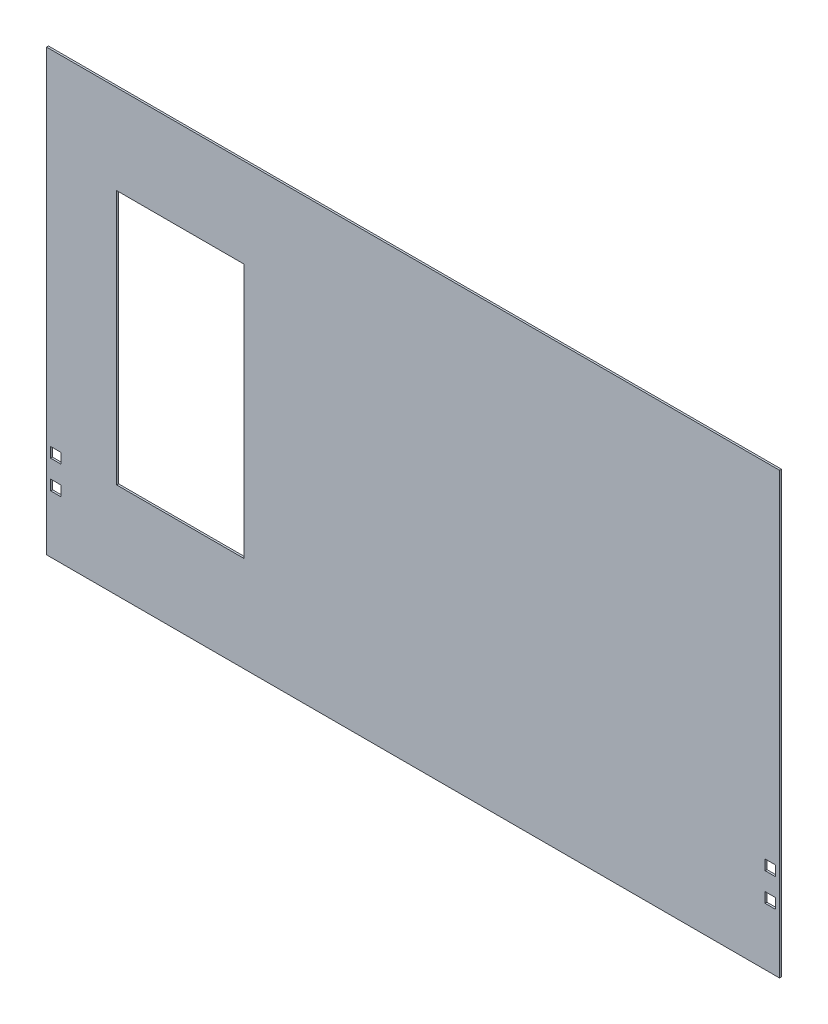
ISO-10303-21;
HEADER;
FILE_DESCRIPTION(('STEP AP214'),'2;1');
FILE_NAME('part.step','',(''),(''),'','','');
FILE_SCHEMA(('AUTOMOTIVE_DESIGN { 1 0 10303 214 1 1 1 1 }'));
ENDSEC;
DATA;
#1=APPLICATION_CONTEXT('core data for automotive mechanical design processes');
#2=APPLICATION_PROTOCOL_DEFINITION('international standard','automotive_design',2000,#1);
#3=PRODUCT_CONTEXT('',#1,'mechanical');
#4=PRODUCT('Part','Part','',(#3));
#5=PRODUCT_RELATED_PRODUCT_CATEGORY('part','',(#4));
#6=PRODUCT_DEFINITION_FORMATION('','',#4);
#7=PRODUCT_DEFINITION_CONTEXT('part definition',#1,'design');
#8=PRODUCT_DEFINITION('design','',#6,#7);
#9=PRODUCT_DEFINITION_SHAPE('','',#8);
#10=(LENGTH_UNIT() NAMED_UNIT(*) SI_UNIT(.MILLI.,.METRE.));
#11=(NAMED_UNIT(*) PLANE_ANGLE_UNIT() SI_UNIT($,.RADIAN.));
#12=(NAMED_UNIT(*) SI_UNIT($,.STERADIAN.) SOLID_ANGLE_UNIT());
#13=UNCERTAINTY_MEASURE_WITH_UNIT(LENGTH_MEASURE(1.E-05),#10,'distance_accuracy_value','');
#14=(GEOMETRIC_REPRESENTATION_CONTEXT(3) GLOBAL_UNCERTAINTY_ASSIGNED_CONTEXT((#13)) GLOBAL_UNIT_ASSIGNED_CONTEXT((#10,
#11,#12)) REPRESENTATION_CONTEXT('',''));
#15=CARTESIAN_POINT('',(0.,0.,0.));
#16=DIRECTION('',(0.,0.,1.));
#17=DIRECTION('',(1.,0.,0.));
#18=AXIS2_PLACEMENT_3D('',#15,#16,#17);
#19=CARTESIAN_POINT('',(0.,0.,-3.));
#20=DIRECTION('',(0.,0.,-1.));
#21=DIRECTION('',(-1.,0.,0.));
#22=AXIS2_PLACEMENT_3D('',#19,#20,#21);
#23=PLANE('',#22);
#24=DIRECTION('',(0.,-1.,0.));
#25=VECTOR('',#24,1.);
#26=CARTESIAN_POINT('',(-465.,260.,-3.));
#27=LINE('',#26,#25);
#28=CARTESIAN_POINT('',(-465.,260.,-3.));
#29=VERTEX_POINT('',#28);
#30=CARTESIAN_POINT('',(-465.,-140.,-3.));
#31=VERTEX_POINT('',#30);
#32=EDGE_CURVE('E395',#29,#31,#27,.T.);
#33=ORIENTED_EDGE('',*,*,#32,.T.);
#34=DIRECTION('',(1.,0.,0.));
#35=VECTOR('',#34,1.);
#36=CARTESIAN_POINT('',(-465.,-140.,-3.));
#37=LINE('',#36,#35);
#38=CARTESIAN_POINT('',(-265.,-140.,-3.));
#39=VERTEX_POINT('',#38);
#40=EDGE_CURVE('E412',#31,#39,#37,.T.);
#41=ORIENTED_EDGE('',*,*,#40,.T.);
#42=DIRECTION('',(0.,1.,0.));
#43=VECTOR('',#42,1.);
#44=CARTESIAN_POINT('',(-265.,260.,-3.));
#45=LINE('',#44,#43);
#46=CARTESIAN_POINT('',(-265.,260.,-3.));
#47=VERTEX_POINT('',#46);
#48=EDGE_CURVE('E328',#39,#47,#45,.T.);
#49=ORIENTED_EDGE('',*,*,#48,.T.);
#50=DIRECTION('',(-1.,0.,0.));
#51=VECTOR('',#50,1.);
#52=CARTESIAN_POINT('',(-465.,260.,-3.));
#53=LINE('',#52,#51);
#54=EDGE_CURVE('E392',#47,#29,#53,.T.);
#55=ORIENTED_EDGE('',*,*,#54,.T.);
#56=EDGE_LOOP('',(#33,#41,#49,#55));
#57=FACE_BOUND('',#56,.T.);
#58=DIRECTION('',(-1.,0.,0.));
#59=VECTOR('',#58,1.);
#60=CARTESIAN_POINT('',(-575.,-290.,-3.));
#61=LINE('',#60,#59);
#62=CARTESIAN_POINT('',(575.,-290.,-3.));
#63=VERTEX_POINT('',#62);
#64=CARTESIAN_POINT('',(-575.,-290.,-3.));
#65=VERTEX_POINT('',#64);
#66=EDGE_CURVE('E421',#63,#65,#61,.T.);
#67=ORIENTED_EDGE('',*,*,#66,.T.);
#68=DIRECTION('',(0.,-1.,0.));
#69=VECTOR('',#68,1.);
#70=CARTESIAN_POINT('',(-575.,-400.,-3.));
#71=LINE('',#70,#69);
#72=CARTESIAN_POINT('',(-575.,400.,-3.));
#73=VERTEX_POINT('',#72);
#74=EDGE_CURVE('E438',#73,#65,#71,.T.);
#75=ORIENTED_EDGE('',*,*,#74,.F.);
#76=DIRECTION('',(-1.,0.,0.));
#77=VECTOR('',#76,1.);
#78=CARTESIAN_POINT('',(-575.,400.,-3.));
#79=LINE('',#78,#77);
#80=CARTESIAN_POINT('',(575.,400.,-3.));
#81=VERTEX_POINT('',#80);
#82=EDGE_CURVE('E434',#81,#73,#79,.T.);
#83=ORIENTED_EDGE('',*,*,#82,.F.);
#84=DIRECTION('',(0.,1.,0.));
#85=VECTOR('',#84,1.);
#86=CARTESIAN_POINT('',(575.,-400.,-3.));
#87=LINE('',#86,#85);
#88=EDGE_CURVE('E432',#63,#81,#87,.T.);
#89=ORIENTED_EDGE('',*,*,#88,.F.);
#90=EDGE_LOOP('',(#67,#75,#83,#89));
#91=FACE_BOUND('',#90,.T.);
#92=DIRECTION('',(0.,-1.,0.));
#93=VECTOR('',#92,1.);
#94=CARTESIAN_POINT('',(568.5,-139.5,-3.));
#95=LINE('',#94,#93);
#96=CARTESIAN_POINT('',(568.5,-139.5,-3.));
#97=VERTEX_POINT('',#96);
#98=CARTESIAN_POINT('',(568.5,-155.5,-3.));
#99=VERTEX_POINT('',#98);
#100=EDGE_CURVE('E379',#97,#99,#95,.T.);
#101=ORIENTED_EDGE('',*,*,#100,.F.);
#102=DIRECTION('',(1.,0.,0.));
#103=VECTOR('',#102,1.);
#104=CARTESIAN_POINT('',(552.5,-139.5,-3.));
#105=LINE('',#104,#103);
#106=CARTESIAN_POINT('',(552.5,-139.5,-3.));
#107=VERTEX_POINT('',#106);
#108=EDGE_CURVE('E382',#107,#97,#105,.T.);
#109=ORIENTED_EDGE('',*,*,#108,.F.);
#110=DIRECTION('',(0.,1.,0.));
#111=VECTOR('',#110,1.);
#112=CARTESIAN_POINT('',(552.5,-155.5,-3.));
#113=LINE('',#112,#111);
#114=CARTESIAN_POINT('',(552.5,-155.5,-3.));
#115=VERTEX_POINT('',#114);
#116=EDGE_CURVE('E348',#115,#107,#113,.T.);
#117=ORIENTED_EDGE('',*,*,#116,.F.);
#118=DIRECTION('',(-1.,0.,0.));
#119=VECTOR('',#118,1.);
#120=CARTESIAN_POINT('',(568.5,-155.5,-3.));
#121=LINE('',#120,#119);
#122=EDGE_CURVE('E342',#99,#115,#121,.T.);
#123=ORIENTED_EDGE('',*,*,#122,.F.);
#124=EDGE_LOOP('',(#101,#109,#117,#123));
#125=FACE_BOUND('',#124,.T.);
#126=DIRECTION('',(0.,-1.,0.));
#127=VECTOR('',#126,1.);
#128=CARTESIAN_POINT('',(568.5,-183.850348269495,-3.));
#129=LINE('',#128,#127);
#130=CARTESIAN_POINT('',(568.5,-183.850348269495,-3.));
#131=VERTEX_POINT('',#130);
#132=CARTESIAN_POINT('',(568.5,-199.850348269495,-3.));
#133=VERTEX_POINT('',#132);
#134=EDGE_CURVE('E329',#131,#133,#129,.T.);
#135=ORIENTED_EDGE('',*,*,#134,.F.);
#136=DIRECTION('',(1.,0.,0.));
#137=VECTOR('',#136,1.);
#138=CARTESIAN_POINT('',(552.5,-183.850348269495,-3.));
#139=LINE('',#138,#137);
#140=CARTESIAN_POINT('',(552.5,-183.850348269495,-3.));
#141=VERTEX_POINT('',#140);
#142=EDGE_CURVE('E332',#141,#131,#139,.T.);
#143=ORIENTED_EDGE('',*,*,#142,.F.);
#144=DIRECTION('',(0.,1.,0.));
#145=VECTOR('',#144,1.);
#146=CARTESIAN_POINT('',(552.5,-199.850348269495,-3.));
#147=LINE('',#146,#145);
#148=CARTESIAN_POINT('',(552.5,-199.850348269495,-3.));
#149=VERTEX_POINT('',#148);
#150=EDGE_CURVE('E294',#149,#141,#147,.T.);
#151=ORIENTED_EDGE('',*,*,#150,.F.);
#152=DIRECTION('',(-1.,0.,0.));
#153=VECTOR('',#152,1.);
#154=CARTESIAN_POINT('',(568.5,-199.850348269495,-3.));
#155=LINE('',#154,#153);
#156=EDGE_CURVE('E323',#133,#149,#155,.T.);
#157=ORIENTED_EDGE('',*,*,#156,.F.);
#158=EDGE_LOOP('',(#135,#143,#151,#157));
#159=FACE_BOUND('',#158,.T.);
#160=DIRECTION('',(0.,1.,0.));
#161=VECTOR('',#160,1.);
#162=CARTESIAN_POINT('',(-552.5,-155.5,-3.));
#163=LINE('',#162,#161);
#164=CARTESIAN_POINT('',(-552.5,-155.5,-3.));
#165=VERTEX_POINT('',#164);
#166=CARTESIAN_POINT('',(-552.5,-139.5,-3.));
#167=VERTEX_POINT('',#166);
#168=EDGE_CURVE('E245',#165,#167,#163,.T.);
#169=ORIENTED_EDGE('',*,*,#168,.T.);
#170=DIRECTION('',(-1.,0.,0.));
#171=VECTOR('',#170,1.);
#172=CARTESIAN_POINT('',(-552.5,-139.5,-3.));
#173=LINE('',#172,#171);
#174=CARTESIAN_POINT('',(-568.5,-139.5,-3.));
#175=VERTEX_POINT('',#174);
#176=EDGE_CURVE('E59',#167,#175,#173,.T.);
#177=ORIENTED_EDGE('',*,*,#176,.T.);
#178=DIRECTION('',(0.,-1.,0.));
#179=VECTOR('',#178,1.);
#180=CARTESIAN_POINT('',(-568.5,-139.5,-3.));
#181=LINE('',#180,#179);
#182=CARTESIAN_POINT('',(-568.5,-155.5,-3.));
#183=VERTEX_POINT('',#182);
#184=EDGE_CURVE('E277',#175,#183,#181,.T.);
#185=ORIENTED_EDGE('',*,*,#184,.T.);
#186=DIRECTION('',(1.,0.,0.));
#187=VECTOR('',#186,1.);
#188=CARTESIAN_POINT('',(-568.5,-155.5,-3.));
#189=LINE('',#188,#187);
#190=EDGE_CURVE('E240',#183,#165,#189,.T.);
#191=ORIENTED_EDGE('',*,*,#190,.T.);
#192=EDGE_LOOP('',(#169,#177,#185,#191));
#193=FACE_BOUND('',#192,.T.);
#194=DIRECTION('',(0.,1.,0.));
#195=VECTOR('',#194,1.);
#196=CARTESIAN_POINT('',(-552.5,-199.850348269495,-3.));
#197=LINE('',#196,#195);
#198=CARTESIAN_POINT('',(-552.5,-199.850348269495,-3.));
#199=VERTEX_POINT('',#198);
#200=CARTESIAN_POINT('',(-552.5,-183.850348269495,-3.));
#201=VERTEX_POINT('',#200);
#202=EDGE_CURVE('E199',#199,#201,#197,.T.);
#203=ORIENTED_EDGE('',*,*,#202,.T.);
#204=DIRECTION('',(-1.,0.,0.));
#205=VECTOR('',#204,1.);
#206=CARTESIAN_POINT('',(-552.5,-183.850348269495,-3.));
#207=LINE('',#206,#205);
#208=CARTESIAN_POINT('',(-568.5,-183.850348269495,-3.));
#209=VERTEX_POINT('',#208);
#210=EDGE_CURVE('E51',#201,#209,#207,.T.);
#211=ORIENTED_EDGE('',*,*,#210,.T.);
#212=DIRECTION('',(0.,-1.,0.));
#213=VECTOR('',#212,1.);
#214=CARTESIAN_POINT('',(-568.5,-183.850348269495,-3.));
#215=LINE('',#214,#213);
#216=CARTESIAN_POINT('',(-568.5,-199.850348269495,-3.));
#217=VERTEX_POINT('',#216);
#218=EDGE_CURVE('E219',#209,#217,#215,.T.);
#219=ORIENTED_EDGE('',*,*,#218,.T.);
#220=DIRECTION('',(1.,0.,0.));
#221=VECTOR('',#220,1.);
#222=CARTESIAN_POINT('',(-568.5,-199.850348269495,-3.));
#223=LINE('',#222,#221);
#224=EDGE_CURVE('E212',#217,#199,#223,.T.);
#225=ORIENTED_EDGE('',*,*,#224,.T.);
#226=EDGE_LOOP('',(#203,#211,#219,#225));
#227=FACE_BOUND('',#226,.T.);
#228=ADVANCED_FACE('F36',(#57,#91,#125,#159,#193,#227),#23,.T.);
#229=CARTESIAN_POINT('',(0.,0.,0.));
#230=DIRECTION('',(0.,0.,-1.));
#231=DIRECTION('',(-1.,0.,0.));
#232=AXIS2_PLACEMENT_3D('',#229,#230,#231);
#233=PLANE('',#232);
#234=CARTESIAN_POINT('',(-552.5,-139.5,0.));
#235=CARTESIAN_POINT('',(-568.5,-139.5,0.));
#236=B_SPLINE_CURVE_WITH_KNOTS('',1,(#234,#235),.UNSPECIFIED.,.F.,.F.,(2,2),(0.,0.25),.UNSPECIFIED.);
#237=CARTESIAN_POINT('',(-552.5,-139.5,0.));
#238=VERTEX_POINT('',#237);
#239=CARTESIAN_POINT('',(-568.5,-139.5,0.));
#240=VERTEX_POINT('',#239);
#241=EDGE_CURVE('E264',#238,#240,#236,.T.);
#242=ORIENTED_EDGE('',*,*,#241,.F.);
#243=CARTESIAN_POINT('',(-552.5,-155.5,0.));
#244=CARTESIAN_POINT('',(-552.5,-139.5,0.));
#245=B_SPLINE_CURVE_WITH_KNOTS('',1,(#243,#244),.UNSPECIFIED.,.F.,.F.,(2,2),(0.75,1.),.UNSPECIFIED.);
#246=CARTESIAN_POINT('',(-552.5,-155.5,0.));
#247=VERTEX_POINT('',#246);
#248=EDGE_CURVE('E241',#247,#238,#245,.T.);
#249=ORIENTED_EDGE('',*,*,#248,.F.);
#250=CARTESIAN_POINT('',(-568.5,-155.5,0.));
#251=CARTESIAN_POINT('',(-552.5,-155.5,0.));
#252=B_SPLINE_CURVE_WITH_KNOTS('',1,(#250,#251),.UNSPECIFIED.,.F.,.F.,(2,2),(0.5,0.75),.UNSPECIFIED.);
#253=CARTESIAN_POINT('',(-568.5,-155.5,0.));
#254=VERTEX_POINT('',#253);
#255=EDGE_CURVE('E247',#254,#247,#252,.T.);
#256=ORIENTED_EDGE('',*,*,#255,.F.);
#257=CARTESIAN_POINT('',(-568.5,-139.5,0.));
#258=CARTESIAN_POINT('',(-568.5,-155.5,0.));
#259=B_SPLINE_CURVE_WITH_KNOTS('',1,(#257,#258),.UNSPECIFIED.,.F.,.F.,(2,2),(0.25,0.5),.UNSPECIFIED.);
#260=EDGE_CURVE('E256',#240,#254,#259,.T.);
#261=ORIENTED_EDGE('',*,*,#260,.F.);
#262=EDGE_LOOP('',(#242,#249,#256,#261));
#263=FACE_BOUND('',#262,.T.);
#264=CARTESIAN_POINT('',(552.5,-139.5,0.));
#265=CARTESIAN_POINT('',(568.5,-139.5,0.));
#266=B_SPLINE_CURVE_WITH_KNOTS('',1,(#264,#265),.UNSPECIFIED.,.F.,.F.,(2,2),(0.,0.25),.UNSPECIFIED.);
#267=CARTESIAN_POINT('',(552.5,-139.5,0.));
#268=VERTEX_POINT('',#267);
#269=CARTESIAN_POINT('',(568.5,-139.5,0.));
#270=VERTEX_POINT('',#269);
#271=EDGE_CURVE('E223',#268,#270,#266,.T.);
#272=ORIENTED_EDGE('',*,*,#271,.T.);
#273=CARTESIAN_POINT('',(568.5,-139.5,0.));
#274=CARTESIAN_POINT('',(568.5,-155.5,0.));
#275=B_SPLINE_CURVE_WITH_KNOTS('',1,(#273,#274),.UNSPECIFIED.,.F.,.F.,(2,2),(0.25,0.5),.UNSPECIFIED.);
#276=CARTESIAN_POINT('',(568.5,-155.5,0.));
#277=VERTEX_POINT('',#276);
#278=EDGE_CURVE('E359',#270,#277,#275,.T.);
#279=ORIENTED_EDGE('',*,*,#278,.T.);
#280=CARTESIAN_POINT('',(568.5,-155.5,0.));
#281=CARTESIAN_POINT('',(552.5,-155.5,0.));
#282=B_SPLINE_CURVE_WITH_KNOTS('',1,(#280,#281),.UNSPECIFIED.,.F.,.F.,(2,2),(0.5,0.75),.UNSPECIFIED.);
#283=CARTESIAN_POINT('',(552.5,-155.5,0.));
#284=VERTEX_POINT('',#283);
#285=EDGE_CURVE('E350',#277,#284,#282,.T.);
#286=ORIENTED_EDGE('',*,*,#285,.T.);
#287=CARTESIAN_POINT('',(552.5,-155.5,0.));
#288=CARTESIAN_POINT('',(552.5,-139.5,0.));
#289=B_SPLINE_CURVE_WITH_KNOTS('',1,(#287,#288),.UNSPECIFIED.,.F.,.F.,(2,2),(0.75,1.),.UNSPECIFIED.);
#290=EDGE_CURVE('E343',#284,#268,#289,.T.);
#291=ORIENTED_EDGE('',*,*,#290,.T.);
#292=EDGE_LOOP('',(#272,#279,#286,#291));
#293=FACE_BOUND('',#292,.T.);
#294=DIRECTION('',(1.,0.,0.));
#295=VECTOR('',#294,1.);
#296=CARTESIAN_POINT('',(-465.,-140.,0.));
#297=LINE('',#296,#295);
#298=CARTESIAN_POINT('',(-465.,-140.,0.));
#299=VERTEX_POINT('',#298);
#300=CARTESIAN_POINT('',(-265.,-140.,0.));
#301=VERTEX_POINT('',#300);
#302=EDGE_CURVE('E400',#299,#301,#297,.T.);
#303=ORIENTED_EDGE('',*,*,#302,.F.);
#304=DIRECTION('',(0.,-1.,0.));
#305=VECTOR('',#304,1.);
#306=CARTESIAN_POINT('',(-465.,260.,0.));
#307=LINE('',#306,#305);
#308=CARTESIAN_POINT('',(-465.,260.,0.));
#309=VERTEX_POINT('',#308);
#310=EDGE_CURVE('E398',#309,#299,#307,.T.);
#311=ORIENTED_EDGE('',*,*,#310,.F.);
#312=DIRECTION('',(-1.,0.,0.));
#313=VECTOR('',#312,1.);
#314=CARTESIAN_POINT('',(-465.,260.,0.));
#315=LINE('',#314,#313);
#316=CARTESIAN_POINT('',(-265.,260.,0.));
#317=VERTEX_POINT('',#316);
#318=EDGE_CURVE('E406',#317,#309,#315,.T.);
#319=ORIENTED_EDGE('',*,*,#318,.F.);
#320=DIRECTION('',(0.,1.,0.));
#321=VECTOR('',#320,1.);
#322=CARTESIAN_POINT('',(-265.,260.,0.));
#323=LINE('',#322,#321);
#324=EDGE_CURVE('E403',#301,#317,#323,.T.);
#325=ORIENTED_EDGE('',*,*,#324,.F.);
#326=EDGE_LOOP('',(#303,#311,#319,#325));
#327=FACE_BOUND('',#326,.T.);
#328=DIRECTION('',(0.,-1.,0.));
#329=VECTOR('',#328,1.);
#330=CARTESIAN_POINT('',(-575.,-400.,0.));
#331=LINE('',#330,#329);
#332=CARTESIAN_POINT('',(-575.,400.,0.));
#333=VERTEX_POINT('',#332);
#334=CARTESIAN_POINT('',(-575.,-290.,0.));
#335=VERTEX_POINT('',#334);
#336=EDGE_CURVE('E435',#333,#335,#331,.T.);
#337=ORIENTED_EDGE('',*,*,#336,.T.);
#338=DIRECTION('',(-1.,0.,0.));
#339=VECTOR('',#338,1.);
#340=CARTESIAN_POINT('',(-575.,-290.,0.));
#341=LINE('',#340,#339);
#342=CARTESIAN_POINT('',(575.,-290.,0.));
#343=VERTEX_POINT('',#342);
#344=EDGE_CURVE('E424',#343,#335,#341,.T.);
#345=ORIENTED_EDGE('',*,*,#344,.F.);
#346=DIRECTION('',(0.,1.,0.));
#347=VECTOR('',#346,1.);
#348=CARTESIAN_POINT('',(575.,-400.,0.));
#349=LINE('',#348,#347);
#350=CARTESIAN_POINT('',(575.,400.,0.));
#351=VERTEX_POINT('',#350);
#352=EDGE_CURVE('E430',#343,#351,#349,.T.);
#353=ORIENTED_EDGE('',*,*,#352,.T.);
#354=DIRECTION('',(-1.,0.,0.));
#355=VECTOR('',#354,1.);
#356=CARTESIAN_POINT('',(-575.,400.,0.));
#357=LINE('',#356,#355);
#358=EDGE_CURVE('E442',#351,#333,#357,.T.);
#359=ORIENTED_EDGE('',*,*,#358,.T.);
#360=EDGE_LOOP('',(#337,#345,#353,#359));
#361=FACE_BOUND('',#360,.T.);
#362=CARTESIAN_POINT('',(552.5,-183.850348269495,0.));
#363=CARTESIAN_POINT('',(568.5,-183.850348269495,0.));
#364=B_SPLINE_CURVE_WITH_KNOTS('',1,(#362,#363),.UNSPECIFIED.,.F.,.F.,(2,2),(0.,0.25),.UNSPECIFIED.);
#365=CARTESIAN_POINT('',(552.5,-183.850348269495,0.));
#366=VERTEX_POINT('',#365);
#367=CARTESIAN_POINT('',(568.5,-183.850348269495,0.));
#368=VERTEX_POINT('',#367);
#369=EDGE_CURVE('E314',#366,#368,#364,.T.);
#370=ORIENTED_EDGE('',*,*,#369,.T.);
#371=CARTESIAN_POINT('',(568.5,-183.850348269495,0.));
#372=CARTESIAN_POINT('',(568.5,-199.850348269495,0.));
#373=B_SPLINE_CURVE_WITH_KNOTS('',1,(#371,#372),.UNSPECIFIED.,.F.,.F.,(2,2),(0.25,0.5),.UNSPECIFIED.);
#374=CARTESIAN_POINT('',(568.5,-199.850348269495,0.));
#375=VERTEX_POINT('',#374);
#376=EDGE_CURVE('E305',#368,#375,#373,.T.);
#377=ORIENTED_EDGE('',*,*,#376,.T.);
#378=CARTESIAN_POINT('',(568.5,-199.850348269495,0.));
#379=CARTESIAN_POINT('',(552.5,-199.850348269495,0.));
#380=B_SPLINE_CURVE_WITH_KNOTS('',1,(#378,#379),.UNSPECIFIED.,.F.,.F.,(2,2),(0.5,0.75),.UNSPECIFIED.);
#381=CARTESIAN_POINT('',(552.5,-199.850348269495,0.));
#382=VERTEX_POINT('',#381);
#383=EDGE_CURVE('E296',#375,#382,#380,.T.);
#384=ORIENTED_EDGE('',*,*,#383,.T.);
#385=CARTESIAN_POINT('',(552.5,-199.850348269495,0.));
#386=CARTESIAN_POINT('',(552.5,-183.850348269495,0.));
#387=B_SPLINE_CURVE_WITH_KNOTS('',1,(#385,#386),.UNSPECIFIED.,.F.,.F.,(2,2),(0.75,1.),.UNSPECIFIED.);
#388=EDGE_CURVE('E289',#382,#366,#387,.T.);
#389=ORIENTED_EDGE('',*,*,#388,.T.);
#390=EDGE_LOOP('',(#370,#377,#384,#389));
#391=FACE_BOUND('',#390,.T.);
#392=CARTESIAN_POINT('',(-552.5,-183.850348269495,0.));
#393=CARTESIAN_POINT('',(-568.5,-183.850348269495,0.));
#394=B_SPLINE_CURVE_WITH_KNOTS('',1,(#392,#393),.UNSPECIFIED.,.F.,.F.,(2,2),(0.,0.25),.UNSPECIFIED.);
#395=CARTESIAN_POINT('',(-552.5,-183.850348269495,0.));
#396=VERTEX_POINT('',#395);
#397=CARTESIAN_POINT('',(-568.5,-183.850348269495,0.));
#398=VERTEX_POINT('',#397);
#399=EDGE_CURVE('E227',#396,#398,#394,.T.);
#400=ORIENTED_EDGE('',*,*,#399,.F.);
#401=CARTESIAN_POINT('',(-552.5,-199.850348269495,0.));
#402=CARTESIAN_POINT('',(-552.5,-183.850348269495,0.));
#403=B_SPLINE_CURVE_WITH_KNOTS('',1,(#401,#402),.UNSPECIFIED.,.F.,.F.,(2,2),(0.75,1.),.UNSPECIFIED.);
#404=CARTESIAN_POINT('',(-552.5,-199.850348269495,0.));
#405=VERTEX_POINT('',#404);
#406=EDGE_CURVE('E207',#405,#396,#403,.T.);
#407=ORIENTED_EDGE('',*,*,#406,.F.);
#408=CARTESIAN_POINT('',(-568.5,-199.850348269495,0.));
#409=CARTESIAN_POINT('',(-552.5,-199.850348269495,0.));
#410=B_SPLINE_CURVE_WITH_KNOTS('',1,(#408,#409),.UNSPECIFIED.,.F.,.F.,(2,2),(0.5,0.75),.UNSPECIFIED.);
#411=CARTESIAN_POINT('',(-568.5,-199.850348269495,0.));
#412=VERTEX_POINT('',#411);
#413=EDGE_CURVE('E215',#412,#405,#410,.T.);
#414=ORIENTED_EDGE('',*,*,#413,.F.);
#415=CARTESIAN_POINT('',(-568.5,-183.850348269495,0.));
#416=CARTESIAN_POINT('',(-568.5,-199.850348269495,0.));
#417=B_SPLINE_CURVE_WITH_KNOTS('',1,(#415,#416),.UNSPECIFIED.,.F.,.F.,(2,2),(0.25,0.5),.UNSPECIFIED.);
#418=EDGE_CURVE('E236',#398,#412,#417,.T.);
#419=ORIENTED_EDGE('',*,*,#418,.F.);
#420=EDGE_LOOP('',(#400,#407,#414,#419));
#421=FACE_BOUND('',#420,.T.);
#422=ADVANCED_FACE('F449',(#263,#293,#327,#361,#391,#421),#233,.F.);
#423=CARTESIAN_POINT('',(575.,-400.,-3.));
#424=DIRECTION('',(1.,0.,0.));
#425=DIRECTION('',(0.,0.,-1.));
#426=AXIS2_PLACEMENT_3D('',#423,#424,#425);
#427=PLANE('',#426);
#428=DIRECTION('',(0.,0.,1.));
#429=VECTOR('',#428,1.);
#430=CARTESIAN_POINT('',(575.,-290.,-3.001));
#431=LINE('',#430,#429);
#432=EDGE_CURVE('E426',#63,#343,#431,.T.);
#433=ORIENTED_EDGE('',*,*,#432,.F.);
#434=ORIENTED_EDGE('',*,*,#88,.T.);
#435=DIRECTION('',(0.,0.,1.));
#436=VECTOR('',#435,1.);
#437=CARTESIAN_POINT('',(575.,400.,-3.));
#438=LINE('',#437,#436);
#439=EDGE_CURVE('E40',#81,#351,#438,.T.);
#440=ORIENTED_EDGE('',*,*,#439,.T.);
#441=ORIENTED_EDGE('',*,*,#352,.F.);
#442=EDGE_LOOP('',(#433,#434,#440,#441));
#443=FACE_BOUND('',#442,.T.);
#444=ADVANCED_FACE('F38',(#443),#427,.T.);
#445=CARTESIAN_POINT('',(-575.,-400.,-3.));
#446=DIRECTION('',(-1.,0.,0.));
#447=DIRECTION('',(0.,0.,1.));
#448=AXIS2_PLACEMENT_3D('',#445,#446,#447);
#449=PLANE('',#448);
#450=DIRECTION('',(0.,0.,1.));
#451=VECTOR('',#450,1.);
#452=CARTESIAN_POINT('',(-575.,-290.,-3.001));
#453=LINE('',#452,#451);
#454=EDGE_CURVE('E427',#65,#335,#453,.T.);
#455=ORIENTED_EDGE('',*,*,#454,.T.);
#456=ORIENTED_EDGE('',*,*,#336,.F.);
#457=DIRECTION('',(0.,0.,1.));
#458=VECTOR('',#457,1.);
#459=CARTESIAN_POINT('',(-575.,400.,-3.));
#460=LINE('',#459,#458);
#461=EDGE_CURVE('E11',#73,#333,#460,.T.);
#462=ORIENTED_EDGE('',*,*,#461,.F.);
#463=ORIENTED_EDGE('',*,*,#74,.T.);
#464=EDGE_LOOP('',(#455,#456,#462,#463));
#465=FACE_BOUND('',#464,.T.);
#466=ADVANCED_FACE('F454',(#465),#449,.T.);
#467=CARTESIAN_POINT('',(-575.,400.,-3.));
#468=DIRECTION('',(0.,1.,0.));
#469=DIRECTION('',(0.,0.,1.));
#470=AXIS2_PLACEMENT_3D('',#467,#468,#469);
#471=PLANE('',#470);
#472=ORIENTED_EDGE('',*,*,#358,.F.);
#473=ORIENTED_EDGE('',*,*,#439,.F.);
#474=ORIENTED_EDGE('',*,*,#82,.T.);
#475=ORIENTED_EDGE('',*,*,#461,.T.);
#476=EDGE_LOOP('',(#472,#473,#474,#475));
#477=FACE_BOUND('',#476,.T.);
#478=ADVANCED_FACE('F467',(#477),#471,.T.);
#479=CARTESIAN_POINT('',(-575.,-290.,-3.001));
#480=DIRECTION('',(0.,1.,0.));
#481=DIRECTION('',(0.,0.,1.));
#482=AXIS2_PLACEMENT_3D('',#479,#480,#481);
#483=PLANE('',#482);
#484=ORIENTED_EDGE('',*,*,#432,.T.);
#485=ORIENTED_EDGE('',*,*,#344,.T.);
#486=ORIENTED_EDGE('',*,*,#454,.F.);
#487=ORIENTED_EDGE('',*,*,#66,.F.);
#488=EDGE_LOOP('',(#484,#485,#486,#487));
#489=FACE_BOUND('',#488,.T.);
#490=ADVANCED_FACE('F457',(#489),#483,.F.);
#491=CARTESIAN_POINT('',(-465.,260.,-3.001));
#492=DIRECTION('',(-1.,0.,0.));
#493=DIRECTION('',(0.,-1.,0.));
#494=AXIS2_PLACEMENT_3D('',#491,#492,#493);
#495=PLANE('',#494);
#496=DIRECTION('',(0.,0.,1.));
#497=VECTOR('',#496,1.);
#498=CARTESIAN_POINT('',(-465.,260.,-3.001));
#499=LINE('',#498,#497);
#500=EDGE_CURVE('E410',#29,#309,#499,.T.);
#501=ORIENTED_EDGE('',*,*,#500,.T.);
#502=ORIENTED_EDGE('',*,*,#310,.T.);
#503=DIRECTION('',(0.,0.,1.));
#504=VECTOR('',#503,1.);
#505=CARTESIAN_POINT('',(-465.,-140.,-3.001));
#506=LINE('',#505,#504);
#507=EDGE_CURVE('E409',#31,#299,#506,.T.);
#508=ORIENTED_EDGE('',*,*,#507,.F.);
#509=ORIENTED_EDGE('',*,*,#32,.F.);
#510=EDGE_LOOP('',(#501,#502,#508,#509));
#511=FACE_BOUND('',#510,.T.);
#512=ADVANCED_FACE('F473',(#511),#495,.F.);
#513=CARTESIAN_POINT('',(-465.,260.,-3.001));
#514=DIRECTION('',(0.,1.,0.));
#515=DIRECTION('',(0.,0.,1.));
#516=AXIS2_PLACEMENT_3D('',#513,#514,#515);
#517=PLANE('',#516);
#518=DIRECTION('',(0.,0.,1.));
#519=VECTOR('',#518,1.);
#520=CARTESIAN_POINT('',(-265.,260.,-3.001));
#521=LINE('',#520,#519);
#522=EDGE_CURVE('E413',#47,#317,#521,.T.);
#523=ORIENTED_EDGE('',*,*,#522,.T.);
#524=ORIENTED_EDGE('',*,*,#318,.T.);
#525=ORIENTED_EDGE('',*,*,#500,.F.);
#526=ORIENTED_EDGE('',*,*,#54,.F.);
#527=EDGE_LOOP('',(#523,#524,#525,#526));
#528=FACE_BOUND('',#527,.T.);
#529=ADVANCED_FACE('F487',(#528),#517,.F.);
#530=CARTESIAN_POINT('',(-265.,260.,-3.001));
#531=DIRECTION('',(1.,0.,0.));
#532=DIRECTION('',(0.,1.,0.));
#533=AXIS2_PLACEMENT_3D('',#530,#531,#532);
#534=PLANE('',#533);
#535=DIRECTION('',(0.,0.,1.));
#536=VECTOR('',#535,1.);
#537=CARTESIAN_POINT('',(-265.,-140.,-3.001));
#538=LINE('',#537,#536);
#539=EDGE_CURVE('E415',#39,#301,#538,.T.);
#540=ORIENTED_EDGE('',*,*,#539,.T.);
#541=ORIENTED_EDGE('',*,*,#324,.T.);
#542=ORIENTED_EDGE('',*,*,#522,.F.);
#543=ORIENTED_EDGE('',*,*,#48,.F.);
#544=EDGE_LOOP('',(#540,#541,#542,#543));
#545=FACE_BOUND('',#544,.T.);
#546=ADVANCED_FACE('F493',(#545),#534,.F.);
#547=CARTESIAN_POINT('',(-465.,-140.,-3.001));
#548=DIRECTION('',(0.,-1.,0.));
#549=DIRECTION('',(0.,0.,-1.));
#550=AXIS2_PLACEMENT_3D('',#547,#548,#549);
#551=PLANE('',#550);
#552=ORIENTED_EDGE('',*,*,#507,.T.);
#553=ORIENTED_EDGE('',*,*,#302,.T.);
#554=ORIENTED_EDGE('',*,*,#539,.F.);
#555=ORIENTED_EDGE('',*,*,#40,.F.);
#556=EDGE_LOOP('',(#552,#553,#554,#555));
#557=FACE_BOUND('',#556,.T.);
#558=ADVANCED_FACE('F489',(#557),#551,.F.);
#559=CARTESIAN_POINT('',(552.5,-139.5,-6.));
#560=DIRECTION('',(0.,-1.,0.));
#561=DIRECTION('',(0.,0.,-1.));
#562=AXIS2_PLACEMENT_3D('',#559,#560,#561);
#563=PLANE('',#562);
#564=ORIENTED_EDGE('',*,*,#108,.T.);
#565=DIRECTION('',(0.,0.,1.));
#566=VECTOR('',#565,1.);
#567=CARTESIAN_POINT('',(568.5,-139.5,-6.));
#568=LINE('',#567,#566);
#569=EDGE_CURVE('E367',#97,#270,#568,.T.);
#570=ORIENTED_EDGE('',*,*,#569,.T.);
#571=ORIENTED_EDGE('',*,*,#271,.F.);
#572=DIRECTION('',(0.,0.,1.));
#573=VECTOR('',#572,1.);
#574=CARTESIAN_POINT('',(552.5,-139.5,-6.));
#575=LINE('',#574,#573);
#576=EDGE_CURVE('E220',#107,#268,#575,.T.);
#577=ORIENTED_EDGE('',*,*,#576,.F.);
#578=EDGE_LOOP('',(#564,#570,#571,#577));
#579=FACE_BOUND('',#578,.T.);
#580=ADVANCED_FACE('F492',(#579),#563,.T.);
#581=CARTESIAN_POINT('',(568.5,-139.5,-6.));
#582=DIRECTION('',(-1.,0.,0.));
#583=DIRECTION('',(0.,0.,1.));
#584=AXIS2_PLACEMENT_3D('',#581,#582,#583);
#585=PLANE('',#584);
#586=ORIENTED_EDGE('',*,*,#100,.T.);
#587=DIRECTION('',(0.,0.,1.));
#588=VECTOR('',#587,1.);
#589=CARTESIAN_POINT('',(568.5,-155.5,-6.));
#590=LINE('',#589,#588);
#591=EDGE_CURVE('E358',#99,#277,#590,.T.);
#592=ORIENTED_EDGE('',*,*,#591,.T.);
#593=ORIENTED_EDGE('',*,*,#278,.F.);
#594=ORIENTED_EDGE('',*,*,#569,.F.);
#595=EDGE_LOOP('',(#586,#592,#593,#594));
#596=FACE_BOUND('',#595,.T.);
#597=ADVANCED_FACE('F503',(#596),#585,.T.);
#598=CARTESIAN_POINT('',(568.5,-155.5,-6.));
#599=DIRECTION('',(0.,1.,0.));
#600=DIRECTION('',(0.,0.,1.));
#601=AXIS2_PLACEMENT_3D('',#598,#599,#600);
#602=PLANE('',#601);
#603=ORIENTED_EDGE('',*,*,#122,.T.);
#604=DIRECTION('',(0.,0.,1.));
#605=VECTOR('',#604,1.);
#606=CARTESIAN_POINT('',(552.5,-155.5,-6.));
#607=LINE('',#606,#605);
#608=EDGE_CURVE('E349',#115,#284,#607,.T.);
#609=ORIENTED_EDGE('',*,*,#608,.T.);
#610=ORIENTED_EDGE('',*,*,#285,.F.);
#611=ORIENTED_EDGE('',*,*,#591,.F.);
#612=EDGE_LOOP('',(#603,#609,#610,#611));
#613=FACE_BOUND('',#612,.T.);
#614=ADVANCED_FACE('F507',(#613),#602,.T.);
#615=CARTESIAN_POINT('',(552.5,-155.5,-6.));
#616=DIRECTION('',(1.,0.,0.));
#617=DIRECTION('',(0.,0.,-1.));
#618=AXIS2_PLACEMENT_3D('',#615,#616,#617);
#619=PLANE('',#618);
#620=ORIENTED_EDGE('',*,*,#116,.T.);
#621=ORIENTED_EDGE('',*,*,#576,.T.);
#622=ORIENTED_EDGE('',*,*,#290,.F.);
#623=ORIENTED_EDGE('',*,*,#608,.F.);
#624=EDGE_LOOP('',(#620,#621,#622,#623));
#625=FACE_BOUND('',#624,.T.);
#626=ADVANCED_FACE('F511',(#625),#619,.T.);
#627=CARTESIAN_POINT('',(552.5,-183.850348269495,-6.));
#628=DIRECTION('',(0.,-1.,0.));
#629=DIRECTION('',(0.,0.,-1.));
#630=AXIS2_PLACEMENT_3D('',#627,#628,#629);
#631=PLANE('',#630);
#632=ORIENTED_EDGE('',*,*,#142,.T.);
#633=DIRECTION('',(0.,0.,1.));
#634=VECTOR('',#633,1.);
#635=CARTESIAN_POINT('',(568.5,-183.850348269495,-6.));
#636=LINE('',#635,#634);
#637=EDGE_CURVE('E313',#131,#368,#636,.T.);
#638=ORIENTED_EDGE('',*,*,#637,.T.);
#639=ORIENTED_EDGE('',*,*,#369,.F.);
#640=DIRECTION('',(0.,0.,1.));
#641=VECTOR('',#640,1.);
#642=CARTESIAN_POINT('',(552.5,-183.850348269495,-6.));
#643=LINE('',#642,#641);
#644=EDGE_CURVE('E322',#141,#366,#643,.T.);
#645=ORIENTED_EDGE('',*,*,#644,.F.);
#646=EDGE_LOOP('',(#632,#638,#639,#645));
#647=FACE_BOUND('',#646,.T.);
#648=ADVANCED_FACE('F515',(#647),#631,.T.);
#649=CARTESIAN_POINT('',(568.5,-183.850348269495,-6.));
#650=DIRECTION('',(-1.,0.,0.));
#651=DIRECTION('',(0.,0.,1.));
#652=AXIS2_PLACEMENT_3D('',#649,#650,#651);
#653=PLANE('',#652);
#654=ORIENTED_EDGE('',*,*,#134,.T.);
#655=DIRECTION('',(0.,0.,1.));
#656=VECTOR('',#655,1.);
#657=CARTESIAN_POINT('',(568.5,-199.850348269495,-6.));
#658=LINE('',#657,#656);
#659=EDGE_CURVE('E304',#133,#375,#658,.T.);
#660=ORIENTED_EDGE('',*,*,#659,.T.);
#661=ORIENTED_EDGE('',*,*,#376,.F.);
#662=ORIENTED_EDGE('',*,*,#637,.F.);
#663=EDGE_LOOP('',(#654,#660,#661,#662));
#664=FACE_BOUND('',#663,.T.);
#665=ADVANCED_FACE('F519',(#664),#653,.T.);
#666=CARTESIAN_POINT('',(568.5,-199.850348269495,-6.));
#667=DIRECTION('',(0.,1.,0.));
#668=DIRECTION('',(0.,0.,1.));
#669=AXIS2_PLACEMENT_3D('',#666,#667,#668);
#670=PLANE('',#669);
#671=ORIENTED_EDGE('',*,*,#156,.T.);
#672=DIRECTION('',(0.,0.,1.));
#673=VECTOR('',#672,1.);
#674=CARTESIAN_POINT('',(552.5,-199.850348269495,-6.));
#675=LINE('',#674,#673);
#676=EDGE_CURVE('E295',#149,#382,#675,.T.);
#677=ORIENTED_EDGE('',*,*,#676,.T.);
#678=ORIENTED_EDGE('',*,*,#383,.F.);
#679=ORIENTED_EDGE('',*,*,#659,.F.);
#680=EDGE_LOOP('',(#671,#677,#678,#679));
#681=FACE_BOUND('',#680,.T.);
#682=ADVANCED_FACE('F523',(#681),#670,.T.);
#683=CARTESIAN_POINT('',(552.5,-199.850348269495,-6.));
#684=DIRECTION('',(1.,0.,0.));
#685=DIRECTION('',(0.,0.,-1.));
#686=AXIS2_PLACEMENT_3D('',#683,#684,#685);
#687=PLANE('',#686);
#688=ORIENTED_EDGE('',*,*,#150,.T.);
#689=ORIENTED_EDGE('',*,*,#644,.T.);
#690=ORIENTED_EDGE('',*,*,#388,.F.);
#691=ORIENTED_EDGE('',*,*,#676,.F.);
#692=EDGE_LOOP('',(#688,#689,#690,#691));
#693=FACE_BOUND('',#692,.T.);
#694=ADVANCED_FACE('F527',(#693),#687,.T.);
#695=CARTESIAN_POINT('',(-552.5,-139.5,-6.));
#696=DIRECTION('',(0.,-1.,0.));
#697=DIRECTION('',(0.,0.,-1.));
#698=AXIS2_PLACEMENT_3D('',#695,#696,#697);
#699=PLANE('',#698);
#700=ORIENTED_EDGE('',*,*,#176,.F.);
#701=DIRECTION('',(0.,0.,1.));
#702=VECTOR('',#701,1.);
#703=CARTESIAN_POINT('',(-552.5,-139.5,-6.));
#704=LINE('',#703,#702);
#705=EDGE_CURVE('E271',#167,#238,#704,.T.);
#706=ORIENTED_EDGE('',*,*,#705,.T.);
#707=ORIENTED_EDGE('',*,*,#241,.T.);
#708=DIRECTION('',(0.,0.,1.));
#709=VECTOR('',#708,1.);
#710=CARTESIAN_POINT('',(-568.5,-139.5,-6.));
#711=LINE('',#710,#709);
#712=EDGE_CURVE('E263',#175,#240,#711,.T.);
#713=ORIENTED_EDGE('',*,*,#712,.F.);
#714=EDGE_LOOP('',(#700,#706,#707,#713));
#715=FACE_BOUND('',#714,.T.);
#716=ADVANCED_FACE('F531',(#715),#699,.T.);
#717=CARTESIAN_POINT('',(-568.5,-139.5,-6.));
#718=DIRECTION('',(1.,0.,0.));
#719=DIRECTION('',(0.,0.,1.));
#720=AXIS2_PLACEMENT_3D('',#717,#718,#719);
#721=PLANE('',#720);
#722=ORIENTED_EDGE('',*,*,#184,.F.);
#723=ORIENTED_EDGE('',*,*,#712,.T.);
#724=ORIENTED_EDGE('',*,*,#260,.T.);
#725=DIRECTION('',(0.,0.,1.));
#726=VECTOR('',#725,1.);
#727=CARTESIAN_POINT('',(-568.5,-155.5,-6.));
#728=LINE('',#727,#726);
#729=EDGE_CURVE('E255',#183,#254,#728,.T.);
#730=ORIENTED_EDGE('',*,*,#729,.F.);
#731=EDGE_LOOP('',(#722,#723,#724,#730));
#732=FACE_BOUND('',#731,.T.);
#733=ADVANCED_FACE('F535',(#732),#721,.T.);
#734=CARTESIAN_POINT('',(-568.5,-155.5,-6.));
#735=DIRECTION('',(0.,1.,0.));
#736=DIRECTION('',(0.,0.,1.));
#737=AXIS2_PLACEMENT_3D('',#734,#735,#736);
#738=PLANE('',#737);
#739=ORIENTED_EDGE('',*,*,#190,.F.);
#740=ORIENTED_EDGE('',*,*,#729,.T.);
#741=ORIENTED_EDGE('',*,*,#255,.T.);
#742=DIRECTION('',(0.,0.,1.));
#743=VECTOR('',#742,1.);
#744=CARTESIAN_POINT('',(-552.5,-155.5,-6.));
#745=LINE('',#744,#743);
#746=EDGE_CURVE('E246',#165,#247,#745,.T.);
#747=ORIENTED_EDGE('',*,*,#746,.F.);
#748=EDGE_LOOP('',(#739,#740,#741,#747));
#749=FACE_BOUND('',#748,.T.);
#750=ADVANCED_FACE('F538',(#749),#738,.T.);
#751=CARTESIAN_POINT('',(-552.5,-155.5,-6.));
#752=DIRECTION('',(-1.,0.,0.));
#753=DIRECTION('',(0.,0.,-1.));
#754=AXIS2_PLACEMENT_3D('',#751,#752,#753);
#755=PLANE('',#754);
#756=ORIENTED_EDGE('',*,*,#168,.F.);
#757=ORIENTED_EDGE('',*,*,#746,.T.);
#758=ORIENTED_EDGE('',*,*,#248,.T.);
#759=ORIENTED_EDGE('',*,*,#705,.F.);
#760=EDGE_LOOP('',(#756,#757,#758,#759));
#761=FACE_BOUND('',#760,.T.);
#762=ADVANCED_FACE('F542',(#761),#755,.T.);
#763=CARTESIAN_POINT('',(-552.5,-183.850348269495,-6.));
#764=DIRECTION('',(0.,-1.,0.));
#765=DIRECTION('',(0.,0.,-1.));
#766=AXIS2_PLACEMENT_3D('',#763,#764,#765);
#767=PLANE('',#766);
#768=ORIENTED_EDGE('',*,*,#210,.F.);
#769=DIRECTION('',(0.,0.,1.));
#770=VECTOR('',#769,1.);
#771=CARTESIAN_POINT('',(-552.5,-183.850348269495,-6.));
#772=LINE('',#771,#770);
#773=EDGE_CURVE('E204',#201,#396,#772,.T.);
#774=ORIENTED_EDGE('',*,*,#773,.T.);
#775=ORIENTED_EDGE('',*,*,#399,.T.);
#776=DIRECTION('',(0.,0.,1.));
#777=VECTOR('',#776,1.);
#778=CARTESIAN_POINT('',(-568.5,-183.850348269495,-6.));
#779=LINE('',#778,#777);
#780=EDGE_CURVE('E233',#209,#398,#779,.T.);
#781=ORIENTED_EDGE('',*,*,#780,.F.);
#782=EDGE_LOOP('',(#768,#774,#775,#781));
#783=FACE_BOUND('',#782,.T.);
#784=ADVANCED_FACE('F546',(#783),#767,.T.);
#785=CARTESIAN_POINT('',(-568.5,-183.850348269495,-6.));
#786=DIRECTION('',(1.,0.,0.));
#787=DIRECTION('',(0.,0.,1.));
#788=AXIS2_PLACEMENT_3D('',#785,#786,#787);
#789=PLANE('',#788);
#790=ORIENTED_EDGE('',*,*,#218,.F.);
#791=ORIENTED_EDGE('',*,*,#780,.T.);
#792=ORIENTED_EDGE('',*,*,#418,.T.);
#793=DIRECTION('',(0.,0.,1.));
#794=VECTOR('',#793,1.);
#795=CARTESIAN_POINT('',(-568.5,-199.850348269495,-6.));
#796=LINE('',#795,#794);
#797=EDGE_CURVE('E237',#217,#412,#796,.T.);
#798=ORIENTED_EDGE('',*,*,#797,.F.);
#799=EDGE_LOOP('',(#790,#791,#792,#798));
#800=FACE_BOUND('',#799,.T.);
#801=ADVANCED_FACE('F550',(#800),#789,.T.);
#802=CARTESIAN_POINT('',(-568.5,-199.850348269495,-6.));
#803=DIRECTION('',(0.,1.,0.));
#804=DIRECTION('',(0.,0.,1.));
#805=AXIS2_PLACEMENT_3D('',#802,#803,#804);
#806=PLANE('',#805);
#807=ORIENTED_EDGE('',*,*,#224,.F.);
#808=ORIENTED_EDGE('',*,*,#797,.T.);
#809=ORIENTED_EDGE('',*,*,#413,.T.);
#810=DIRECTION('',(0.,0.,1.));
#811=VECTOR('',#810,1.);
#812=CARTESIAN_POINT('',(-552.5,-199.850348269495,-6.));
#813=LINE('',#812,#811);
#814=EDGE_CURVE('E202',#199,#405,#813,.T.);
#815=ORIENTED_EDGE('',*,*,#814,.F.);
#816=EDGE_LOOP('',(#807,#808,#809,#815));
#817=FACE_BOUND('',#816,.T.);
#818=ADVANCED_FACE('F210',(#817),#806,.T.);
#819=CARTESIAN_POINT('',(-552.5,-199.850348269495,-6.));
#820=DIRECTION('',(-1.,0.,0.));
#821=DIRECTION('',(0.,0.,-1.));
#822=AXIS2_PLACEMENT_3D('',#819,#820,#821);
#823=PLANE('',#822);
#824=ORIENTED_EDGE('',*,*,#202,.F.);
#825=ORIENTED_EDGE('',*,*,#814,.T.);
#826=ORIENTED_EDGE('',*,*,#406,.T.);
#827=ORIENTED_EDGE('',*,*,#773,.F.);
#828=EDGE_LOOP('',(#824,#825,#826,#827));
#829=FACE_BOUND('',#828,.T.);
#830=ADVANCED_FACE('F201',(#829),#823,.T.);
#831=CLOSED_SHELL('',(#228,#422,#444,#466,#478,#490,#512,#529,#546,#558,#580,#597,#614,#626,
#648,#665,#682,#694,#716,#733,#750,#762,#784,#801,#818,#830));
#832=MANIFOLD_SOLID_BREP('B2',#831);
#833=ADVANCED_BREP_SHAPE_REPRESENTATION('',(#18,#832),#14);
#834=SHAPE_DEFINITION_REPRESENTATION(#9,#833);
ENDSEC;
END-ISO-10303-21;
